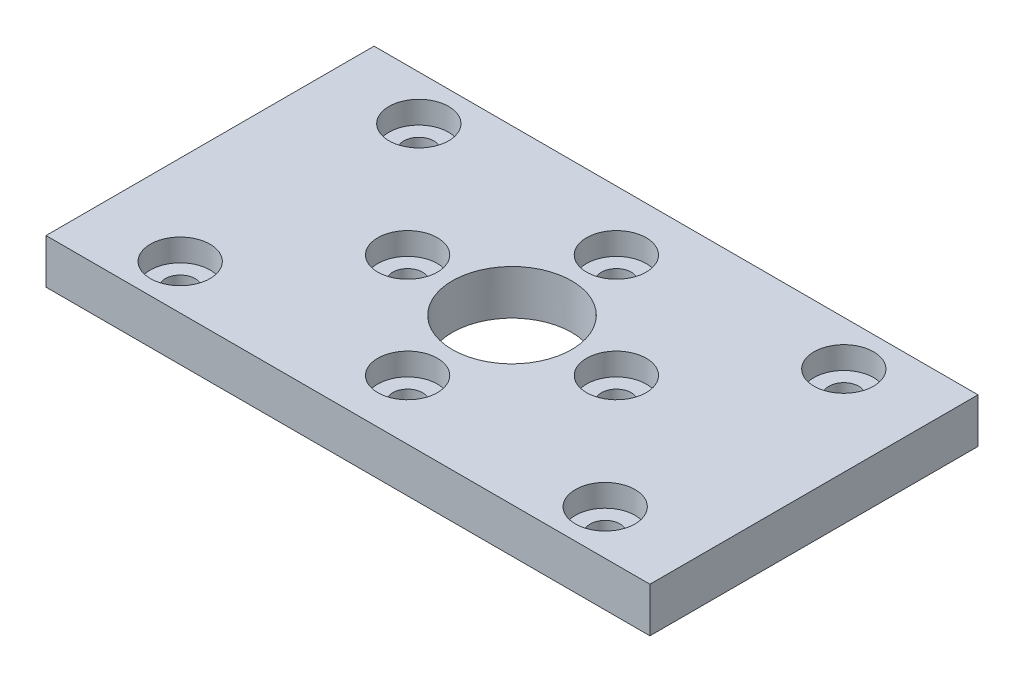
ISO-10303-21;
HEADER;
FILE_DESCRIPTION(('STEP AP214'),'2;1');
FILE_NAME('part.step','',(''),(''),'','','');
FILE_SCHEMA(('AUTOMOTIVE_DESIGN { 1 0 10303 214 1 1 1 1 }'));
ENDSEC;
DATA;
#1=APPLICATION_CONTEXT('core data for automotive mechanical design processes');
#2=APPLICATION_PROTOCOL_DEFINITION('international standard','automotive_design',2000,#1);
#3=PRODUCT_CONTEXT('',#1,'mechanical');
#4=PRODUCT('Part','Part','',(#3));
#5=PRODUCT_RELATED_PRODUCT_CATEGORY('part','',(#4));
#6=PRODUCT_DEFINITION_FORMATION('','',#4);
#7=PRODUCT_DEFINITION_CONTEXT('part definition',#1,'design');
#8=PRODUCT_DEFINITION('design','',#6,#7);
#9=PRODUCT_DEFINITION_SHAPE('','',#8);
#10=(LENGTH_UNIT() NAMED_UNIT(*) SI_UNIT(.MILLI.,.METRE.));
#11=(NAMED_UNIT(*) PLANE_ANGLE_UNIT() SI_UNIT($,.RADIAN.));
#12=(NAMED_UNIT(*) SI_UNIT($,.STERADIAN.) SOLID_ANGLE_UNIT());
#13=UNCERTAINTY_MEASURE_WITH_UNIT(LENGTH_MEASURE(1.E-05),#10,'distance_accuracy_value','');
#14=(GEOMETRIC_REPRESENTATION_CONTEXT(3) GLOBAL_UNCERTAINTY_ASSIGNED_CONTEXT((#13)) GLOBAL_UNIT_ASSIGNED_CONTEXT((#10,
#11,#12)) REPRESENTATION_CONTEXT('',''));
#15=CARTESIAN_POINT('',(0.,0.,0.));
#16=DIRECTION('',(0.,0.,1.));
#17=DIRECTION('',(1.,0.,0.));
#18=AXIS2_PLACEMENT_3D('',#15,#16,#17);
#19=CARTESIAN_POINT('',(14.25,-7.,8.));
#20=DIRECTION('',(0.,1.,0.));
#21=DIRECTION('',(0.,0.,1.));
#22=AXIS2_PLACEMENT_3D('',#19,#20,#21);
#23=CYLINDRICAL_SURFACE('',#22,1.);
#24=CARTESIAN_POINT('',(14.25,0.,8.));
#25=DIRECTION('',(0.,-1.,0.));
#26=DIRECTION('',(0.,0.,-1.));
#27=AXIS2_PLACEMENT_3D('',#24,#25,#26);
#28=CIRCLE('',#27,1.);
#29=CARTESIAN_POINT('',(14.25,0.,7.));
#30=VERTEX_POINT('',#29);
#31=EDGE_CURVE('E118',#30,#30,#28,.T.);
#32=ORIENTED_EDGE('',*,*,#31,.T.);
#33=EDGE_LOOP('',(#32));
#34=FACE_BOUND('',#33,.T.);
#35=CARTESIAN_POINT('',(14.25,1.5,8.));
#36=DIRECTION('',(0.,1.,0.));
#37=DIRECTION('',(0.,0.,1.));
#38=AXIS2_PLACEMENT_3D('',#35,#36,#37);
#39=CIRCLE('',#38,1.);
#40=CARTESIAN_POINT('',(14.25,1.5,9.));
#41=VERTEX_POINT('',#40);
#42=EDGE_CURVE('E158',#41,#41,#39,.F.);
#43=ORIENTED_EDGE('',*,*,#42,.F.);
#44=EDGE_LOOP('',(#43));
#45=FACE_BOUND('',#44,.T.);
#46=ADVANCED_FACE('F36',(#34,#45),#23,.F.);
#47=CARTESIAN_POINT('',(-14.25,-7.,8.));
#48=DIRECTION('',(0.,1.,0.));
#49=DIRECTION('',(0.,0.,1.));
#50=AXIS2_PLACEMENT_3D('',#47,#48,#49);
#51=CYLINDRICAL_SURFACE('',#50,1.);
#52=CARTESIAN_POINT('',(-14.25,0.,8.));
#53=DIRECTION('',(0.,-1.,0.));
#54=DIRECTION('',(0.,0.,-1.));
#55=AXIS2_PLACEMENT_3D('',#52,#53,#54);
#56=CIRCLE('',#55,1.);
#57=CARTESIAN_POINT('',(-14.25,0.,7.));
#58=VERTEX_POINT('',#57);
#59=EDGE_CURVE('E114',#58,#58,#56,.T.);
#60=ORIENTED_EDGE('',*,*,#59,.T.);
#61=EDGE_LOOP('',(#60));
#62=FACE_BOUND('',#61,.T.);
#63=CARTESIAN_POINT('',(-14.25,1.5,8.));
#64=DIRECTION('',(0.,1.,0.));
#65=DIRECTION('',(0.,0.,1.));
#66=AXIS2_PLACEMENT_3D('',#63,#64,#65);
#67=CIRCLE('',#66,1.);
#68=CARTESIAN_POINT('',(-14.25,1.5,9.));
#69=VERTEX_POINT('',#68);
#70=EDGE_CURVE('E156',#69,#69,#67,.F.);
#71=ORIENTED_EDGE('',*,*,#70,.F.);
#72=EDGE_LOOP('',(#71));
#73=FACE_BOUND('',#72,.T.);
#74=ADVANCED_FACE('F196',(#62,#73),#51,.F.);
#75=CARTESIAN_POINT('',(-6.9999999999998,-7.,1.98951966012828E-13));
#76=DIRECTION('',(0.,1.,0.));
#77=DIRECTION('',(0.,0.,1.));
#78=AXIS2_PLACEMENT_3D('',#75,#76,#77);
#79=CYLINDRICAL_SURFACE('',#78,1.00000000000032);
#80=CARTESIAN_POINT('',(-6.9999999999998,0.,1.98951966012828E-13));
#81=DIRECTION('',(0.,-1.,0.));
#82=DIRECTION('',(0.,0.,-1.));
#83=AXIS2_PLACEMENT_3D('',#80,#81,#82);
#84=CIRCLE('',#83,1.00000000000032);
#85=CARTESIAN_POINT('',(-6.9999999999998,0.,-1.00000000000012));
#86=VERTEX_POINT('',#85);
#87=EDGE_CURVE('E131',#86,#86,#84,.T.);
#88=ORIENTED_EDGE('',*,*,#87,.T.);
#89=EDGE_LOOP('',(#88));
#90=FACE_BOUND('',#89,.T.);
#91=CARTESIAN_POINT('',(-6.9999999999998,1.5,1.98951966012828E-13));
#92=DIRECTION('',(0.,1.,0.));
#93=DIRECTION('',(0.,0.,1.));
#94=AXIS2_PLACEMENT_3D('',#91,#92,#93);
#95=CIRCLE('',#94,1.00000000000032);
#96=CARTESIAN_POINT('',(-6.9999999999998,1.5,1.00000000000052));
#97=VERTEX_POINT('',#96);
#98=EDGE_CURVE('E150',#97,#97,#95,.F.);
#99=ORIENTED_EDGE('',*,*,#98,.F.);
#100=EDGE_LOOP('',(#99));
#101=FACE_BOUND('',#100,.T.);
#102=ADVANCED_FACE('F202',(#90,#101),#79,.F.);
#103=CARTESIAN_POINT('',(3.9618942650685E-13,-7.,7.));
#104=DIRECTION('',(0.,1.,0.));
#105=DIRECTION('',(0.,0.,1.));
#106=AXIS2_PLACEMENT_3D('',#103,#104,#105);
#107=CYLINDRICAL_SURFACE('',#106,1.00000000000043);
#108=CARTESIAN_POINT('',(3.9618942650685E-13,0.,7.));
#109=DIRECTION('',(0.,-1.,0.));
#110=DIRECTION('',(0.,0.,-1.));
#111=AXIS2_PLACEMENT_3D('',#108,#109,#110);
#112=CIRCLE('',#111,1.00000000000043);
#113=CARTESIAN_POINT('',(3.9618942650685E-13,0.,5.99999999999957));
#114=VERTEX_POINT('',#113);
#115=EDGE_CURVE('E134',#114,#114,#112,.T.);
#116=ORIENTED_EDGE('',*,*,#115,.T.);
#117=EDGE_LOOP('',(#116));
#118=FACE_BOUND('',#117,.T.);
#119=CARTESIAN_POINT('',(3.9618942650685E-13,1.5,7.));
#120=DIRECTION('',(0.,1.,0.));
#121=DIRECTION('',(0.,0.,1.));
#122=AXIS2_PLACEMENT_3D('',#119,#120,#121);
#123=CIRCLE('',#122,1.00000000000043);
#124=CARTESIAN_POINT('',(3.9618942650685E-13,1.5,8.00000000000042));
#125=VERTEX_POINT('',#124);
#126=EDGE_CURVE('E146',#125,#125,#123,.F.);
#127=ORIENTED_EDGE('',*,*,#126,.F.);
#128=EDGE_LOOP('',(#127));
#129=FACE_BOUND('',#128,.T.);
#130=ADVANCED_FACE('F226',(#118,#129),#107,.F.);
#131=CARTESIAN_POINT('',(7.0000000000002,-7.,-1.98094713253425E-13));
#132=DIRECTION('',(0.,1.,0.));
#133=DIRECTION('',(0.,0.,1.));
#134=AXIS2_PLACEMENT_3D('',#131,#132,#133);
#135=CYLINDRICAL_SURFACE('',#134,1.00000000000015);
#136=CARTESIAN_POINT('',(7.0000000000002,0.,-1.98094713253425E-13));
#137=DIRECTION('',(0.,-1.,0.));
#138=DIRECTION('',(0.,0.,-1.));
#139=AXIS2_PLACEMENT_3D('',#136,#137,#138);
#140=CIRCLE('',#139,1.00000000000015);
#141=CARTESIAN_POINT('',(7.0000000000002,0.,-1.00000000000035));
#142=VERTEX_POINT('',#141);
#143=EDGE_CURVE('E130',#142,#142,#140,.T.);
#144=ORIENTED_EDGE('',*,*,#143,.T.);
#145=EDGE_LOOP('',(#144));
#146=FACE_BOUND('',#145,.T.);
#147=CARTESIAN_POINT('',(7.0000000000002,1.5,-1.98094713253425E-13));
#148=DIRECTION('',(0.,1.,0.));
#149=DIRECTION('',(0.,0.,1.));
#150=AXIS2_PLACEMENT_3D('',#147,#148,#149);
#151=CIRCLE('',#150,1.00000000000015);
#152=CARTESIAN_POINT('',(7.0000000000002,1.5,0.999999999999957));
#153=VERTEX_POINT('',#152);
#154=EDGE_CURVE('E143',#153,#153,#151,.F.);
#155=ORIENTED_EDGE('',*,*,#154,.F.);
#156=EDGE_LOOP('',(#155));
#157=FACE_BOUND('',#156,.T.);
#158=ADVANCED_FACE('F221',(#146,#157),#135,.F.);
#159=CARTESIAN_POINT('',(20.25,3.,11.));
#160=DIRECTION('',(-1.,0.,0.));
#161=DIRECTION('',(0.,0.,1.));
#162=AXIS2_PLACEMENT_3D('',#159,#160,#161);
#163=PLANE('',#162);
#164=DIRECTION('',(0.,0.,-1.));
#165=VECTOR('',#164,1.);
#166=CARTESIAN_POINT('',(20.25,0.,11.));
#167=LINE('',#166,#165);
#168=CARTESIAN_POINT('',(20.25,0.,11.));
#169=VERTEX_POINT('',#168);
#170=CARTESIAN_POINT('',(20.25,0.,-11.));
#171=VERTEX_POINT('',#170);
#172=EDGE_CURVE('E103',#169,#171,#167,.T.);
#173=ORIENTED_EDGE('',*,*,#172,.T.);
#174=DIRECTION('',(0.,-1.,0.));
#175=VECTOR('',#174,1.);
#176=CARTESIAN_POINT('',(20.25,3.,-11.));
#177=LINE('',#176,#175);
#178=CARTESIAN_POINT('',(20.25,3.,-11.));
#179=VERTEX_POINT('',#178);
#180=EDGE_CURVE('E11',#179,#171,#177,.T.);
#181=ORIENTED_EDGE('',*,*,#180,.F.);
#182=DIRECTION('',(0.,0.,-1.));
#183=VECTOR('',#182,1.);
#184=CARTESIAN_POINT('',(20.25,3.,11.));
#185=LINE('',#184,#183);
#186=CARTESIAN_POINT('',(20.25,3.,11.));
#187=VERTEX_POINT('',#186);
#188=EDGE_CURVE('E90',#187,#179,#185,.T.);
#189=ORIENTED_EDGE('',*,*,#188,.F.);
#190=DIRECTION('',(0.,-1.,0.));
#191=VECTOR('',#190,1.);
#192=CARTESIAN_POINT('',(20.25,3.,11.));
#193=LINE('',#192,#191);
#194=EDGE_CURVE('E99',#187,#169,#193,.T.);
#195=ORIENTED_EDGE('',*,*,#194,.T.);
#196=EDGE_LOOP('',(#173,#181,#189,#195));
#197=FACE_BOUND('',#196,.T.);
#198=ADVANCED_FACE('F38',(#197),#163,.F.);
#199=CARTESIAN_POINT('',(-20.25,3.,-11.));
#200=DIRECTION('',(0.,0.,1.));
#201=DIRECTION('',(1.,0.,0.));
#202=AXIS2_PLACEMENT_3D('',#199,#200,#201);
#203=PLANE('',#202);
#204=DIRECTION('',(-1.,0.,0.));
#205=VECTOR('',#204,1.);
#206=CARTESIAN_POINT('',(-20.25,0.,-11.));
#207=LINE('',#206,#205);
#208=CARTESIAN_POINT('',(-20.25,0.,-11.));
#209=VERTEX_POINT('',#208);
#210=EDGE_CURVE('E94',#171,#209,#207,.T.);
#211=ORIENTED_EDGE('',*,*,#210,.T.);
#212=DIRECTION('',(0.,-1.,0.));
#213=VECTOR('',#212,1.);
#214=CARTESIAN_POINT('',(-20.25,3.,-11.));
#215=LINE('',#214,#213);
#216=CARTESIAN_POINT('',(-20.25,3.,-11.));
#217=VERTEX_POINT('',#216);
#218=EDGE_CURVE('E46',#217,#209,#215,.T.);
#219=ORIENTED_EDGE('',*,*,#218,.F.);
#220=DIRECTION('',(-1.,0.,0.));
#221=VECTOR('',#220,1.);
#222=CARTESIAN_POINT('',(-20.25,3.,-11.));
#223=LINE('',#222,#221);
#224=EDGE_CURVE('E85',#179,#217,#223,.T.);
#225=ORIENTED_EDGE('',*,*,#224,.F.);
#226=ORIENTED_EDGE('',*,*,#180,.T.);
#227=EDGE_LOOP('',(#211,#219,#225,#226));
#228=FACE_BOUND('',#227,.T.);
#229=ADVANCED_FACE('F93',(#228),#203,.F.);
#230=CARTESIAN_POINT('',(-20.25,3.,11.));
#231=DIRECTION('',(1.,0.,0.));
#232=DIRECTION('',(0.,0.,-1.));
#233=AXIS2_PLACEMENT_3D('',#230,#231,#232);
#234=PLANE('',#233);
#235=DIRECTION('',(0.,0.,1.));
#236=VECTOR('',#235,1.);
#237=CARTESIAN_POINT('',(-20.25,0.,11.));
#238=LINE('',#237,#236);
#239=CARTESIAN_POINT('',(-20.25,0.,11.));
#240=VERTEX_POINT('',#239);
#241=EDGE_CURVE('E72',#209,#240,#238,.T.);
#242=ORIENTED_EDGE('',*,*,#241,.T.);
#243=DIRECTION('',(0.,-1.,0.));
#244=VECTOR('',#243,1.);
#245=CARTESIAN_POINT('',(-20.25,3.,11.));
#246=LINE('',#245,#244);
#247=CARTESIAN_POINT('',(-20.25,3.,11.));
#248=VERTEX_POINT('',#247);
#249=EDGE_CURVE('E95',#248,#240,#246,.T.);
#250=ORIENTED_EDGE('',*,*,#249,.F.);
#251=DIRECTION('',(0.,0.,1.));
#252=VECTOR('',#251,1.);
#253=CARTESIAN_POINT('',(-20.25,3.,11.));
#254=LINE('',#253,#252);
#255=EDGE_CURVE('E88',#217,#248,#254,.T.);
#256=ORIENTED_EDGE('',*,*,#255,.F.);
#257=ORIENTED_EDGE('',*,*,#218,.T.);
#258=EDGE_LOOP('',(#242,#250,#256,#257));
#259=FACE_BOUND('',#258,.T.);
#260=ADVANCED_FACE('F97',(#259),#234,.F.);
#261=CARTESIAN_POINT('',(-20.25,3.,11.));
#262=DIRECTION('',(0.,0.,-1.));
#263=DIRECTION('',(-1.,0.,0.));
#264=AXIS2_PLACEMENT_3D('',#261,#262,#263);
#265=PLANE('',#264);
#266=DIRECTION('',(1.,0.,0.));
#267=VECTOR('',#266,1.);
#268=CARTESIAN_POINT('',(-20.25,0.,11.));
#269=LINE('',#268,#267);
#270=EDGE_CURVE('E78',#240,#169,#269,.T.);
#271=ORIENTED_EDGE('',*,*,#270,.T.);
#272=ORIENTED_EDGE('',*,*,#194,.F.);
#273=DIRECTION('',(1.,0.,0.));
#274=VECTOR('',#273,1.);
#275=CARTESIAN_POINT('',(-20.25,3.,11.));
#276=LINE('',#275,#274);
#277=EDGE_CURVE('E55',#248,#187,#276,.T.);
#278=ORIENTED_EDGE('',*,*,#277,.F.);
#279=ORIENTED_EDGE('',*,*,#249,.T.);
#280=EDGE_LOOP('',(#271,#272,#278,#279));
#281=FACE_BOUND('',#280,.T.);
#282=ADVANCED_FACE('F181',(#281),#265,.F.);
#283=CARTESIAN_POINT('',(0.,3.,0.));
#284=DIRECTION('',(0.,-1.,0.));
#285=DIRECTION('',(0.,0.,-1.));
#286=AXIS2_PLACEMENT_3D('',#283,#284,#285);
#287=PLANE('',#286);
#288=CARTESIAN_POINT('',(-14.25,3.,8.));
#289=DIRECTION('',(0.,1.,0.));
#290=DIRECTION('',(0.,0.,1.));
#291=AXIS2_PLACEMENT_3D('',#288,#289,#290);
#292=CIRCLE('',#291,2.);
#293=CARTESIAN_POINT('',(-14.25,3.,10.));
#294=VERTEX_POINT('',#293);
#295=EDGE_CURVE('E418',#294,#294,#292,.T.);
#296=ORIENTED_EDGE('',*,*,#295,.F.);
#297=EDGE_LOOP('',(#296));
#298=FACE_BOUND('',#297,.T.);
#299=CARTESIAN_POINT('',(3.9618942650685E-13,3.,7.));
#300=DIRECTION('',(0.,1.,0.));
#301=DIRECTION('',(0.,0.,1.));
#302=AXIS2_PLACEMENT_3D('',#299,#300,#301);
#303=CIRCLE('',#302,2.);
#304=CARTESIAN_POINT('',(3.9618942650685E-13,3.,9.));
#305=VERTEX_POINT('',#304);
#306=EDGE_CURVE('E424',#305,#305,#303,.T.);
#307=ORIENTED_EDGE('',*,*,#306,.F.);
#308=EDGE_LOOP('',(#307));
#309=FACE_BOUND('',#308,.T.);
#310=CARTESIAN_POINT('',(14.25,3.,8.));
#311=DIRECTION('',(0.,1.,0.));
#312=DIRECTION('',(0.,0.,1.));
#313=AXIS2_PLACEMENT_3D('',#310,#311,#312);
#314=CIRCLE('',#313,2.);
#315=CARTESIAN_POINT('',(14.25,3.,10.));
#316=VERTEX_POINT('',#315);
#317=EDGE_CURVE('E411',#316,#316,#314,.T.);
#318=ORIENTED_EDGE('',*,*,#317,.F.);
#319=EDGE_LOOP('',(#318));
#320=FACE_BOUND('',#319,.T.);
#321=CARTESIAN_POINT('',(-14.2500000000001,3.,-7.99999999999969));
#322=DIRECTION('',(0.,1.,0.));
#323=DIRECTION('',(0.,0.,-1.));
#324=AXIS2_PLACEMENT_3D('',#321,#322,#323);
#325=CIRCLE('',#324,2.);
#326=CARTESIAN_POINT('',(-14.2500000000001,3.,-9.99999999999969));
#327=VERTEX_POINT('',#326);
#328=EDGE_CURVE('E408',#327,#327,#325,.T.);
#329=ORIENTED_EDGE('',*,*,#328,.F.);
#330=EDGE_LOOP('',(#329));
#331=FACE_BOUND('',#330,.T.);
#332=CARTESIAN_POINT('',(-6.9999999999998,3.,1.98951966012828E-13));
#333=DIRECTION('',(0.,1.,0.));
#334=DIRECTION('',(0.,0.,1.));
#335=AXIS2_PLACEMENT_3D('',#332,#333,#334);
#336=CIRCLE('',#335,2.);
#337=CARTESIAN_POINT('',(-6.9999999999998,3.,2.0000000000002));
#338=VERTEX_POINT('',#337);
#339=EDGE_CURVE('E417',#338,#338,#336,.T.);
#340=ORIENTED_EDGE('',*,*,#339,.F.);
#341=EDGE_LOOP('',(#340));
#342=FACE_BOUND('',#341,.T.);
#343=CARTESIAN_POINT('',(7.0000000000002,3.,-1.98094713253425E-13));
#344=DIRECTION('',(0.,1.,0.));
#345=DIRECTION('',(0.,0.,1.));
#346=AXIS2_PLACEMENT_3D('',#343,#344,#345);
#347=CIRCLE('',#346,2.);
#348=CARTESIAN_POINT('',(7.0000000000002,3.,1.9999999999998));
#349=VERTEX_POINT('',#348);
#350=EDGE_CURVE('E436',#349,#349,#347,.T.);
#351=ORIENTED_EDGE('',*,*,#350,.F.);
#352=EDGE_LOOP('',(#351));
#353=FACE_BOUND('',#352,.T.);
#354=CARTESIAN_POINT('',(3.40678275275592E-13,3.,-6.99999999999981));
#355=DIRECTION('',(0.,1.,0.));
#356=DIRECTION('',(0.,0.,-1.));
#357=AXIS2_PLACEMENT_3D('',#354,#355,#356);
#358=CIRCLE('',#357,2.);
#359=CARTESIAN_POINT('',(3.40678275275592E-13,3.,-8.99999999999981));
#360=VERTEX_POINT('',#359);
#361=EDGE_CURVE('E430',#360,#360,#358,.T.);
#362=ORIENTED_EDGE('',*,*,#361,.F.);
#363=EDGE_LOOP('',(#362));
#364=FACE_BOUND('',#363,.T.);
#365=CARTESIAN_POINT('',(14.2499999999999,3.,-7.99999999999992));
#366=DIRECTION('',(0.,1.,0.));
#367=DIRECTION('',(0.,0.,-1.));
#368=AXIS2_PLACEMENT_3D('',#365,#366,#367);
#369=CIRCLE('',#368,2.);
#370=CARTESIAN_POINT('',(14.2499999999999,3.,-9.99999999999991));
#371=VERTEX_POINT('',#370);
#372=EDGE_CURVE('E163',#371,#371,#369,.T.);
#373=ORIENTED_EDGE('',*,*,#372,.F.);
#374=EDGE_LOOP('',(#373));
#375=FACE_BOUND('',#374,.T.);
#376=CARTESIAN_POINT('',(0.,3.,0.));
#377=DIRECTION('',(0.,1.,0.));
#378=DIRECTION('',(0.,0.,1.));
#379=AXIS2_PLACEMENT_3D('',#376,#377,#378);
#380=CIRCLE('',#379,4.);
#381=CARTESIAN_POINT('',(0.,3.,4.));
#382=VERTEX_POINT('',#381);
#383=EDGE_CURVE('E126',#382,#382,#380,.T.);
#384=ORIENTED_EDGE('',*,*,#383,.F.);
#385=EDGE_LOOP('',(#384));
#386=FACE_BOUND('',#385,.T.);
#387=ORIENTED_EDGE('',*,*,#188,.T.);
#388=ORIENTED_EDGE('',*,*,#224,.T.);
#389=ORIENTED_EDGE('',*,*,#255,.T.);
#390=ORIENTED_EDGE('',*,*,#277,.T.);
#391=EDGE_LOOP('',(#387,#388,#389,#390));
#392=FACE_BOUND('',#391,.T.);
#393=ADVANCED_FACE('F86',(#298,#309,#320,#331,#342,#353,#364,#375,#386,#392),#287,.F.);
#394=CARTESIAN_POINT('',(0.,0.,0.));
#395=DIRECTION('',(0.,-1.,0.));
#396=DIRECTION('',(0.,0.,-1.));
#397=AXIS2_PLACEMENT_3D('',#394,#395,#396);
#398=PLANE('',#397);
#399=ORIENTED_EDGE('',*,*,#143,.F.);
#400=EDGE_LOOP('',(#399));
#401=FACE_BOUND('',#400,.T.);
#402=ORIENTED_EDGE('',*,*,#115,.F.);
#403=EDGE_LOOP('',(#402));
#404=FACE_BOUND('',#403,.T.);
#405=ORIENTED_EDGE('',*,*,#87,.F.);
#406=EDGE_LOOP('',(#405));
#407=FACE_BOUND('',#406,.T.);
#408=CARTESIAN_POINT('',(0.,0.,-7.));
#409=DIRECTION('',(0.,-1.,0.));
#410=DIRECTION('',(0.,0.,-1.));
#411=AXIS2_PLACEMENT_3D('',#408,#409,#410);
#412=CIRCLE('',#411,1.);
#413=CARTESIAN_POINT('',(0.,0.,-8.));
#414=VERTEX_POINT('',#413);
#415=EDGE_CURVE('E127',#414,#414,#412,.T.);
#416=ORIENTED_EDGE('',*,*,#415,.F.);
#417=EDGE_LOOP('',(#416));
#418=FACE_BOUND('',#417,.T.);
#419=CARTESIAN_POINT('',(0.,0.,0.));
#420=DIRECTION('',(0.,-1.,0.));
#421=DIRECTION('',(0.,0.,-1.));
#422=AXIS2_PLACEMENT_3D('',#419,#420,#421);
#423=CIRCLE('',#422,4.);
#424=CARTESIAN_POINT('',(0.,0.,-4.));
#425=VERTEX_POINT('',#424);
#426=EDGE_CURVE('E119',#425,#425,#423,.T.);
#427=ORIENTED_EDGE('',*,*,#426,.F.);
#428=EDGE_LOOP('',(#427));
#429=FACE_BOUND('',#428,.T.);
#430=ORIENTED_EDGE('',*,*,#59,.F.);
#431=EDGE_LOOP('',(#430));
#432=FACE_BOUND('',#431,.T.);
#433=ORIENTED_EDGE('',*,*,#31,.F.);
#434=EDGE_LOOP('',(#433));
#435=FACE_BOUND('',#434,.T.);
#436=CARTESIAN_POINT('',(14.25,0.,-7.99999999999999));
#437=DIRECTION('',(0.,-1.,0.));
#438=DIRECTION('',(0.,0.,-1.));
#439=AXIS2_PLACEMENT_3D('',#436,#437,#438);
#440=CIRCLE('',#439,0.999999999999999);
#441=CARTESIAN_POINT('',(14.25,0.,-8.99999999999999));
#442=VERTEX_POINT('',#441);
#443=EDGE_CURVE('E115',#442,#442,#440,.T.);
#444=ORIENTED_EDGE('',*,*,#443,.F.);
#445=EDGE_LOOP('',(#444));
#446=FACE_BOUND('',#445,.T.);
#447=CARTESIAN_POINT('',(-14.25,0.,-8.));
#448=DIRECTION('',(0.,-1.,0.));
#449=DIRECTION('',(0.,0.,-1.));
#450=AXIS2_PLACEMENT_3D('',#447,#448,#449);
#451=CIRCLE('',#450,0.999999999999999);
#452=CARTESIAN_POINT('',(-14.25,0.,-9.));
#453=VERTEX_POINT('',#452);
#454=EDGE_CURVE('E106',#453,#453,#451,.T.);
#455=ORIENTED_EDGE('',*,*,#454,.F.);
#456=EDGE_LOOP('',(#455));
#457=FACE_BOUND('',#456,.T.);
#458=ORIENTED_EDGE('',*,*,#172,.F.);
#459=ORIENTED_EDGE('',*,*,#270,.F.);
#460=ORIENTED_EDGE('',*,*,#241,.F.);
#461=ORIENTED_EDGE('',*,*,#210,.F.);
#462=EDGE_LOOP('',(#458,#459,#460,#461));
#463=FACE_BOUND('',#462,.T.);
#464=ADVANCED_FACE('F180',(#401,#404,#407,#418,#429,#432,#435,#446,#457,#463),#398,.T.);
#465=CARTESIAN_POINT('',(-14.25,-7.,-8.));
#466=DIRECTION('',(0.,1.,0.));
#467=DIRECTION('',(0.,0.,1.));
#468=AXIS2_PLACEMENT_3D('',#465,#466,#467);
#469=CYLINDRICAL_SURFACE('',#468,0.999999999999999);
#470=CARTESIAN_POINT('',(-14.25,1.5,-8.));
#471=DIRECTION('',(0.,-1.,0.));
#472=DIRECTION('',(0.,0.,-1.));
#473=AXIS2_PLACEMENT_3D('',#470,#471,#472);
#474=CIRCLE('',#473,0.999999999999999);
#475=CARTESIAN_POINT('',(-14.25,1.5,-9.));
#476=VERTEX_POINT('',#475);
#477=EDGE_CURVE('E40',#476,#476,#474,.F.);
#478=ORIENTED_EDGE('',*,*,#477,.T.);
#479=EDGE_LOOP('',(#478));
#480=FACE_BOUND('',#479,.T.);
#481=ORIENTED_EDGE('',*,*,#454,.T.);
#482=EDGE_LOOP('',(#481));
#483=FACE_BOUND('',#482,.T.);
#484=ADVANCED_FACE('F188',(#480,#483),#469,.F.);
#485=CARTESIAN_POINT('',(14.25,-7.,-7.99999999999999));
#486=DIRECTION('',(0.,1.,0.));
#487=DIRECTION('',(0.,0.,1.));
#488=AXIS2_PLACEMENT_3D('',#485,#486,#487);
#489=CYLINDRICAL_SURFACE('',#488,0.999999999999999);
#490=CARTESIAN_POINT('',(14.25,1.5,-7.99999999999999));
#491=DIRECTION('',(0.,-1.,0.));
#492=DIRECTION('',(0.,0.,-1.));
#493=AXIS2_PLACEMENT_3D('',#490,#491,#492);
#494=CIRCLE('',#493,0.999999999999999);
#495=CARTESIAN_POINT('',(14.25,1.5,-8.99999999999999));
#496=VERTEX_POINT('',#495);
#497=EDGE_CURVE('E135',#496,#496,#494,.F.);
#498=ORIENTED_EDGE('',*,*,#497,.T.);
#499=EDGE_LOOP('',(#498));
#500=FACE_BOUND('',#499,.T.);
#501=ORIENTED_EDGE('',*,*,#443,.T.);
#502=EDGE_LOOP('',(#501));
#503=FACE_BOUND('',#502,.T.);
#504=ADVANCED_FACE('F208',(#500,#503),#489,.F.);
#505=CARTESIAN_POINT('',(0.,-7.,0.));
#506=DIRECTION('',(0.,1.,0.));
#507=DIRECTION('',(0.,0.,1.));
#508=AXIS2_PLACEMENT_3D('',#505,#506,#507);
#509=CYLINDRICAL_SURFACE('',#508,4.);
#510=ORIENTED_EDGE('',*,*,#426,.T.);
#511=EDGE_LOOP('',(#510));
#512=FACE_BOUND('',#511,.T.);
#513=ORIENTED_EDGE('',*,*,#383,.T.);
#514=EDGE_LOOP('',(#513));
#515=FACE_BOUND('',#514,.T.);
#516=ADVANCED_FACE('F177',(#512,#515),#509,.F.);
#517=CARTESIAN_POINT('',(0.,-7.,-7.));
#518=DIRECTION('',(0.,1.,0.));
#519=DIRECTION('',(0.,0.,1.));
#520=AXIS2_PLACEMENT_3D('',#517,#518,#519);
#521=CYLINDRICAL_SURFACE('',#520,1.);
#522=CARTESIAN_POINT('',(0.,1.5,-7.));
#523=DIRECTION('',(0.,-1.,0.));
#524=DIRECTION('',(0.,0.,-1.));
#525=AXIS2_PLACEMENT_3D('',#522,#523,#524);
#526=CIRCLE('',#525,1.);
#527=CARTESIAN_POINT('',(0.,1.5,-8.));
#528=VERTEX_POINT('',#527);
#529=EDGE_CURVE('E153',#528,#528,#526,.F.);
#530=ORIENTED_EDGE('',*,*,#529,.T.);
#531=EDGE_LOOP('',(#530));
#532=FACE_BOUND('',#531,.T.);
#533=ORIENTED_EDGE('',*,*,#415,.T.);
#534=EDGE_LOOP('',(#533));
#535=FACE_BOUND('',#534,.T.);
#536=ADVANCED_FACE('F242',(#532,#535),#521,.F.);
#537=CARTESIAN_POINT('',(14.2499999999999,1.5,-7.99999999999992));
#538=DIRECTION('',(0.,-1.,0.));
#539=DIRECTION('',(0.,0.,-1.));
#540=AXIS2_PLACEMENT_3D('',#537,#538,#539);
#541=PLANE('',#540);
#542=CARTESIAN_POINT('',(14.2499999999999,1.5,-7.99999999999992));
#543=DIRECTION('',(0.,1.,0.));
#544=DIRECTION('',(0.,0.,-1.));
#545=AXIS2_PLACEMENT_3D('',#542,#543,#544);
#546=CIRCLE('',#545,2.);
#547=CARTESIAN_POINT('',(14.2499999999999,1.5,-9.99999999999991));
#548=VERTEX_POINT('',#547);
#549=EDGE_CURVE('E142',#548,#548,#546,.T.);
#550=ORIENTED_EDGE('',*,*,#549,.T.);
#551=EDGE_LOOP('',(#550));
#552=FACE_BOUND('',#551,.T.);
#553=ORIENTED_EDGE('',*,*,#497,.F.);
#554=EDGE_LOOP('',(#553));
#555=FACE_BOUND('',#554,.T.);
#556=ADVANCED_FACE('F244',(#552,#555),#541,.F.);
#557=CARTESIAN_POINT('',(14.2499999999999,1.5,-7.99999999999992));
#558=DIRECTION('',(0.,1.,0.));
#559=DIRECTION('',(0.,0.,1.));
#560=AXIS2_PLACEMENT_3D('',#557,#558,#559);
#561=CYLINDRICAL_SURFACE('',#560,2.);
#562=ORIENTED_EDGE('',*,*,#549,.F.);
#563=EDGE_LOOP('',(#562));
#564=FACE_BOUND('',#563,.T.);
#565=ORIENTED_EDGE('',*,*,#372,.T.);
#566=EDGE_LOOP('',(#565));
#567=FACE_BOUND('',#566,.T.);
#568=ADVANCED_FACE('F236',(#564,#567),#561,.F.);
#569=CARTESIAN_POINT('',(7.0000000000002,1.5,-1.98094713253425E-13));
#570=DIRECTION('',(0.,1.,0.));
#571=DIRECTION('',(0.,0.,1.));
#572=AXIS2_PLACEMENT_3D('',#569,#570,#571);
#573=PLANE('',#572);
#574=CARTESIAN_POINT('',(7.0000000000002,1.5,-1.98094713253425E-13));
#575=DIRECTION('',(0.,1.,0.));
#576=DIRECTION('',(0.,0.,1.));
#577=AXIS2_PLACEMENT_3D('',#574,#575,#576);
#578=CIRCLE('',#577,2.);
#579=CARTESIAN_POINT('',(7.0000000000002,1.5,1.9999999999998));
#580=VERTEX_POINT('',#579);
#581=EDGE_CURVE('E433',#580,#580,#578,.T.);
#582=ORIENTED_EDGE('',*,*,#581,.T.);
#583=EDGE_LOOP('',(#582));
#584=FACE_BOUND('',#583,.T.);
#585=ORIENTED_EDGE('',*,*,#154,.T.);
#586=EDGE_LOOP('',(#585));
#587=FACE_BOUND('',#586,.T.);
#588=ADVANCED_FACE('F297',(#584,#587),#573,.T.);
#589=CARTESIAN_POINT('',(7.0000000000002,1.5,-1.98094713253425E-13));
#590=DIRECTION('',(0.,1.,0.));
#591=DIRECTION('',(0.,0.,1.));
#592=AXIS2_PLACEMENT_3D('',#589,#590,#591);
#593=CYLINDRICAL_SURFACE('',#592,2.);
#594=ORIENTED_EDGE('',*,*,#581,.F.);
#595=EDGE_LOOP('',(#594));
#596=FACE_BOUND('',#595,.T.);
#597=ORIENTED_EDGE('',*,*,#350,.T.);
#598=EDGE_LOOP('',(#597));
#599=FACE_BOUND('',#598,.T.);
#600=ADVANCED_FACE('F287',(#596,#599),#593,.F.);
#601=CARTESIAN_POINT('',(3.9618942650685E-13,1.5,7.));
#602=DIRECTION('',(0.,1.,0.));
#603=DIRECTION('',(0.,0.,1.));
#604=AXIS2_PLACEMENT_3D('',#601,#602,#603);
#605=PLANE('',#604);
#606=CARTESIAN_POINT('',(3.9618942650685E-13,1.5,7.));
#607=DIRECTION('',(0.,1.,0.));
#608=DIRECTION('',(0.,0.,1.));
#609=AXIS2_PLACEMENT_3D('',#606,#607,#608);
#610=CIRCLE('',#609,2.);
#611=CARTESIAN_POINT('',(3.9618942650685E-13,1.5,9.));
#612=VERTEX_POINT('',#611);
#613=EDGE_CURVE('E421',#612,#612,#610,.T.);
#614=ORIENTED_EDGE('',*,*,#613,.T.);
#615=EDGE_LOOP('',(#614));
#616=FACE_BOUND('',#615,.T.);
#617=ORIENTED_EDGE('',*,*,#126,.T.);
#618=EDGE_LOOP('',(#617));
#619=FACE_BOUND('',#618,.T.);
#620=ADVANCED_FACE('F283',(#616,#619),#605,.T.);
#621=CARTESIAN_POINT('',(3.9618942650685E-13,1.5,7.));
#622=DIRECTION('',(0.,1.,0.));
#623=DIRECTION('',(0.,0.,1.));
#624=AXIS2_PLACEMENT_3D('',#621,#622,#623);
#625=CYLINDRICAL_SURFACE('',#624,2.);
#626=ORIENTED_EDGE('',*,*,#613,.F.);
#627=EDGE_LOOP('',(#626));
#628=FACE_BOUND('',#627,.T.);
#629=ORIENTED_EDGE('',*,*,#306,.T.);
#630=EDGE_LOOP('',(#629));
#631=FACE_BOUND('',#630,.T.);
#632=ADVANCED_FACE('F286',(#628,#631),#625,.F.);
#633=CARTESIAN_POINT('',(-6.9999999999998,1.5,1.98951966012828E-13));
#634=DIRECTION('',(0.,1.,0.));
#635=DIRECTION('',(0.,0.,1.));
#636=AXIS2_PLACEMENT_3D('',#633,#634,#635);
#637=PLANE('',#636);
#638=CARTESIAN_POINT('',(-6.9999999999998,1.5,1.98951966012828E-13));
#639=DIRECTION('',(0.,1.,0.));
#640=DIRECTION('',(0.,0.,1.));
#641=AXIS2_PLACEMENT_3D('',#638,#639,#640);
#642=CIRCLE('',#641,2.);
#643=CARTESIAN_POINT('',(-6.9999999999998,1.5,2.0000000000002));
#644=VERTEX_POINT('',#643);
#645=EDGE_CURVE('E439',#644,#644,#642,.T.);
#646=ORIENTED_EDGE('',*,*,#645,.T.);
#647=EDGE_LOOP('',(#646));
#648=FACE_BOUND('',#647,.T.);
#649=ORIENTED_EDGE('',*,*,#98,.T.);
#650=EDGE_LOOP('',(#649));
#651=FACE_BOUND('',#650,.T.);
#652=ADVANCED_FACE('F291',(#648,#651),#637,.T.);
#653=CARTESIAN_POINT('',(-6.9999999999998,1.5,1.98951966012828E-13));
#654=DIRECTION('',(0.,1.,0.));
#655=DIRECTION('',(0.,0.,1.));
#656=AXIS2_PLACEMENT_3D('',#653,#654,#655);
#657=CYLINDRICAL_SURFACE('',#656,2.);
#658=ORIENTED_EDGE('',*,*,#645,.F.);
#659=EDGE_LOOP('',(#658));
#660=FACE_BOUND('',#659,.T.);
#661=ORIENTED_EDGE('',*,*,#339,.T.);
#662=EDGE_LOOP('',(#661));
#663=FACE_BOUND('',#662,.T.);
#664=ADVANCED_FACE('F294',(#660,#663),#657,.F.);
#665=CARTESIAN_POINT('',(3.40678275275592E-13,1.5,-6.99999999999981));
#666=DIRECTION('',(0.,-1.,0.));
#667=DIRECTION('',(0.,0.,-1.));
#668=AXIS2_PLACEMENT_3D('',#665,#666,#667);
#669=PLANE('',#668);
#670=CARTESIAN_POINT('',(3.40678275275592E-13,1.5,-6.99999999999981));
#671=DIRECTION('',(0.,1.,0.));
#672=DIRECTION('',(0.,0.,-1.));
#673=AXIS2_PLACEMENT_3D('',#670,#671,#672);
#674=CIRCLE('',#673,2.);
#675=CARTESIAN_POINT('',(3.40678275275592E-13,1.5,-8.99999999999981));
#676=VERTEX_POINT('',#675);
#677=EDGE_CURVE('E147',#676,#676,#674,.T.);
#678=ORIENTED_EDGE('',*,*,#677,.T.);
#679=EDGE_LOOP('',(#678));
#680=FACE_BOUND('',#679,.T.);
#681=ORIENTED_EDGE('',*,*,#529,.F.);
#682=EDGE_LOOP('',(#681));
#683=FACE_BOUND('',#682,.T.);
#684=ADVANCED_FACE('F275',(#680,#683),#669,.F.);
#685=CARTESIAN_POINT('',(3.40678275275592E-13,1.5,-6.99999999999981));
#686=DIRECTION('',(0.,1.,0.));
#687=DIRECTION('',(0.,0.,1.));
#688=AXIS2_PLACEMENT_3D('',#685,#686,#687);
#689=CYLINDRICAL_SURFACE('',#688,2.);
#690=ORIENTED_EDGE('',*,*,#677,.F.);
#691=EDGE_LOOP('',(#690));
#692=FACE_BOUND('',#691,.T.);
#693=ORIENTED_EDGE('',*,*,#361,.T.);
#694=EDGE_LOOP('',(#693));
#695=FACE_BOUND('',#694,.T.);
#696=ADVANCED_FACE('F265',(#692,#695),#689,.F.);
#697=CARTESIAN_POINT('',(-14.25,1.5,8.));
#698=DIRECTION('',(0.,1.,0.));
#699=DIRECTION('',(0.,0.,1.));
#700=AXIS2_PLACEMENT_3D('',#697,#698,#699);
#701=PLANE('',#700);
#702=CARTESIAN_POINT('',(-14.25,1.5,8.));
#703=DIRECTION('',(0.,1.,0.));
#704=DIRECTION('',(0.,0.,1.));
#705=AXIS2_PLACEMENT_3D('',#702,#703,#704);
#706=CIRCLE('',#705,2.);
#707=CARTESIAN_POINT('',(-14.25,1.5,10.));
#708=VERTEX_POINT('',#707);
#709=EDGE_CURVE('E415',#708,#708,#706,.T.);
#710=ORIENTED_EDGE('',*,*,#709,.T.);
#711=EDGE_LOOP('',(#710));
#712=FACE_BOUND('',#711,.T.);
#713=ORIENTED_EDGE('',*,*,#70,.T.);
#714=EDGE_LOOP('',(#713));
#715=FACE_BOUND('',#714,.T.);
#716=ADVANCED_FACE('F262',(#712,#715),#701,.T.);
#717=CARTESIAN_POINT('',(-14.25,1.5,8.));
#718=DIRECTION('',(0.,1.,0.));
#719=DIRECTION('',(0.,0.,1.));
#720=AXIS2_PLACEMENT_3D('',#717,#718,#719);
#721=CYLINDRICAL_SURFACE('',#720,2.);
#722=ORIENTED_EDGE('',*,*,#709,.F.);
#723=EDGE_LOOP('',(#722));
#724=FACE_BOUND('',#723,.T.);
#725=ORIENTED_EDGE('',*,*,#295,.T.);
#726=EDGE_LOOP('',(#725));
#727=FACE_BOUND('',#726,.T.);
#728=ADVANCED_FACE('F264',(#724,#727),#721,.F.);
#729=CARTESIAN_POINT('',(14.25,1.5,8.));
#730=DIRECTION('',(0.,1.,0.));
#731=DIRECTION('',(0.,0.,1.));
#732=AXIS2_PLACEMENT_3D('',#729,#730,#731);
#733=PLANE('',#732);
#734=CARTESIAN_POINT('',(14.25,1.5,8.));
#735=DIRECTION('',(0.,1.,0.));
#736=DIRECTION('',(0.,0.,1.));
#737=AXIS2_PLACEMENT_3D('',#734,#735,#736);
#738=CIRCLE('',#737,2.);
#739=CARTESIAN_POINT('',(14.25,1.5,10.));
#740=VERTEX_POINT('',#739);
#741=EDGE_CURVE('E427',#740,#740,#738,.T.);
#742=ORIENTED_EDGE('',*,*,#741,.T.);
#743=EDGE_LOOP('',(#742));
#744=FACE_BOUND('',#743,.T.);
#745=ORIENTED_EDGE('',*,*,#42,.T.);
#746=EDGE_LOOP('',(#745));
#747=FACE_BOUND('',#746,.T.);
#748=ADVANCED_FACE('F272',(#744,#747),#733,.T.);
#749=CARTESIAN_POINT('',(14.25,1.5,8.));
#750=DIRECTION('',(0.,1.,0.));
#751=DIRECTION('',(0.,0.,1.));
#752=AXIS2_PLACEMENT_3D('',#749,#750,#751);
#753=CYLINDRICAL_SURFACE('',#752,2.);
#754=ORIENTED_EDGE('',*,*,#741,.F.);
#755=EDGE_LOOP('',(#754));
#756=FACE_BOUND('',#755,.T.);
#757=ORIENTED_EDGE('',*,*,#317,.T.);
#758=EDGE_LOOP('',(#757));
#759=FACE_BOUND('',#758,.T.);
#760=ADVANCED_FACE('F371',(#756,#759),#753,.F.);
#761=CARTESIAN_POINT('',(-14.2500000000001,1.5,-7.99999999999969));
#762=DIRECTION('',(0.,-1.,0.));
#763=DIRECTION('',(0.,0.,-1.));
#764=AXIS2_PLACEMENT_3D('',#761,#762,#763);
#765=PLANE('',#764);
#766=CARTESIAN_POINT('',(-14.2500000000001,1.5,-7.99999999999969));
#767=DIRECTION('',(0.,1.,0.));
#768=DIRECTION('',(0.,0.,-1.));
#769=AXIS2_PLACEMENT_3D('',#766,#767,#768);
#770=CIRCLE('',#769,2.);
#771=CARTESIAN_POINT('',(-14.2500000000001,1.5,-9.99999999999969));
#772=VERTEX_POINT('',#771);
#773=EDGE_CURVE('E405',#772,#772,#770,.T.);
#774=ORIENTED_EDGE('',*,*,#773,.T.);
#775=EDGE_LOOP('',(#774));
#776=FACE_BOUND('',#775,.T.);
#777=ORIENTED_EDGE('',*,*,#477,.F.);
#778=EDGE_LOOP('',(#777));
#779=FACE_BOUND('',#778,.T.);
#780=ADVANCED_FACE('F381',(#776,#779),#765,.F.);
#781=CARTESIAN_POINT('',(-14.2500000000001,1.5,-7.99999999999969));
#782=DIRECTION('',(0.,1.,0.));
#783=DIRECTION('',(0.,0.,1.));
#784=AXIS2_PLACEMENT_3D('',#781,#782,#783);
#785=CYLINDRICAL_SURFACE('',#784,2.);
#786=ORIENTED_EDGE('',*,*,#773,.F.);
#787=EDGE_LOOP('',(#786));
#788=FACE_BOUND('',#787,.T.);
#789=ORIENTED_EDGE('',*,*,#328,.T.);
#790=EDGE_LOOP('',(#789));
#791=FACE_BOUND('',#790,.T.);
#792=ADVANCED_FACE('F280',(#788,#791),#785,.F.);
#793=CLOSED_SHELL('',(#46,#74,#102,#130,#158,#198,#229,#260,#282,#393,#464,#484,#504,#516,#536,
#556,#568,#588,#600,#620,#632,#652,#664,#684,#696,#716,#728,#748,#760,#780,#792));
#794=MANIFOLD_SOLID_BREP('B2',#793);
#795=ADVANCED_BREP_SHAPE_REPRESENTATION('',(#18,#794),#14);
#796=SHAPE_DEFINITION_REPRESENTATION(#9,#795);
ENDSEC;
END-ISO-10303-21;
